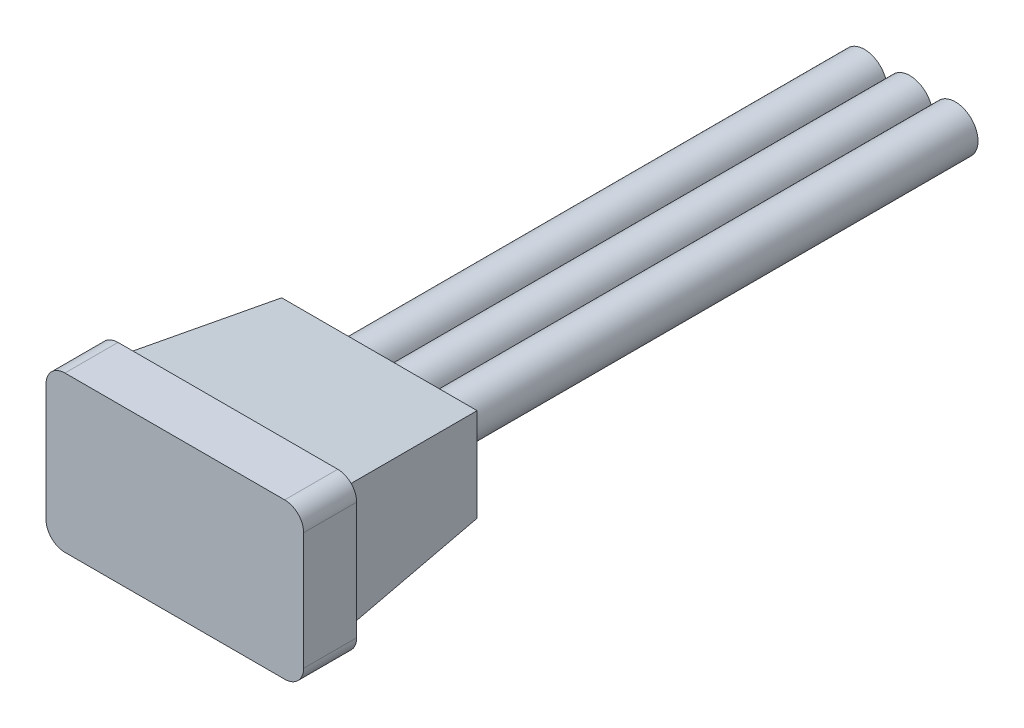
ISO-10303-21;
HEADER;
FILE_DESCRIPTION(('STEP AP214'),'2;1');
FILE_NAME('part.step','',(''),(''),'','','');
FILE_SCHEMA(('AUTOMOTIVE_DESIGN { 1 0 10303 214 1 1 1 1 }'));
ENDSEC;
DATA;
#1=APPLICATION_CONTEXT('core data for automotive mechanical design processes');
#2=APPLICATION_PROTOCOL_DEFINITION('international standard','automotive_design',2000,#1);
#3=PRODUCT_CONTEXT('',#1,'mechanical');
#4=PRODUCT('Part','Part','',(#3));
#5=PRODUCT_RELATED_PRODUCT_CATEGORY('part','',(#4));
#6=PRODUCT_DEFINITION_FORMATION('','',#4);
#7=PRODUCT_DEFINITION_CONTEXT('part definition',#1,'design');
#8=PRODUCT_DEFINITION('design','',#6,#7);
#9=PRODUCT_DEFINITION_SHAPE('','',#8);
#10=(LENGTH_UNIT() NAMED_UNIT(*) SI_UNIT(.MILLI.,.METRE.));
#11=(NAMED_UNIT(*) PLANE_ANGLE_UNIT() SI_UNIT($,.RADIAN.));
#12=(NAMED_UNIT(*) SI_UNIT($,.STERADIAN.) SOLID_ANGLE_UNIT());
#13=UNCERTAINTY_MEASURE_WITH_UNIT(LENGTH_MEASURE(1.E-05),#10,'distance_accuracy_value','');
#14=(GEOMETRIC_REPRESENTATION_CONTEXT(3) GLOBAL_UNCERTAINTY_ASSIGNED_CONTEXT((#13)) GLOBAL_UNIT_ASSIGNED_CONTEXT((#10,
#11,#12)) REPRESENTATION_CONTEXT('',''));
#15=CARTESIAN_POINT('',(0.,0.,0.));
#16=DIRECTION('',(0.,0.,1.));
#17=DIRECTION('',(1.,0.,0.));
#18=AXIS2_PLACEMENT_3D('',#15,#16,#17);
#19=CARTESIAN_POINT('',(1.2,0.,-21.0970562748477));
#20=DIRECTION('',(0.,0.,1.));
#21=DIRECTION('',(1.,0.,0.));
#22=AXIS2_PLACEMENT_3D('',#19,#20,#21);
#23=CYLINDRICAL_SURFACE('',#22,0.6);
#24=CARTESIAN_POINT('',(1.2,0.,-5.4));
#25=DIRECTION('',(0.,0.,-1.));
#26=DIRECTION('',(-1.,0.,0.));
#27=AXIS2_PLACEMENT_3D('',#24,#25,#26);
#28=CIRCLE('',#27,0.6);
#29=CARTESIAN_POINT('',(0.6,0.,-5.4));
#30=VERTEX_POINT('',#29);
#31=EDGE_CURVE('E56',#30,#30,#28,.T.);
#32=ORIENTED_EDGE('',*,*,#31,.T.);
#33=EDGE_LOOP('',(#32));
#34=FACE_BOUND('',#33,.T.);
#35=CARTESIAN_POINT('',(1.2,0.,-19.4));
#36=DIRECTION('',(0.,0.,-1.));
#37=DIRECTION('',(-1.,0.,0.));
#38=AXIS2_PLACEMENT_3D('',#35,#36,#37);
#39=CIRCLE('',#38,0.6);
#40=CARTESIAN_POINT('',(0.6,0.,-19.4));
#41=VERTEX_POINT('',#40);
#42=EDGE_CURVE('E11',#41,#41,#39,.T.);
#43=ORIENTED_EDGE('',*,*,#42,.F.);
#44=EDGE_LOOP('',(#43));
#45=FACE_BOUND('',#44,.T.);
#46=ADVANCED_FACE('F49',(#34,#45),#23,.T.);
#47=CARTESIAN_POINT('',(1.2,0.,-5.4));
#48=DIRECTION('',(0.,0.,-1.));
#49=DIRECTION('',(-1.,0.,0.));
#50=AXIS2_PLACEMENT_3D('',#47,#48,#49);
#51=PLANE('',#50);
#52=ORIENTED_EDGE('',*,*,#31,.F.);
#53=EDGE_LOOP('',(#52));
#54=FACE_BOUND('',#53,.T.);
#55=ADVANCED_FACE('F64',(#54),#51,.F.);
#56=CARTESIAN_POINT('',(0.,0.,-19.4));
#57=DIRECTION('',(0.,0.,-1.));
#58=DIRECTION('',(-1.,0.,0.));
#59=AXIS2_PLACEMENT_3D('',#56,#57,#58);
#60=PLANE('',#59);
#61=ORIENTED_EDGE('',*,*,#42,.T.);
#62=EDGE_LOOP('',(#61));
#63=FACE_BOUND('',#62,.T.);
#64=ADVANCED_FACE('F51',(#63),#60,.T.);
#65=CLOSED_SHELL('',(#46,#55,#64));
#66=MANIFOLD_SOLID_BREP('B2',#65);
#67=CARTESIAN_POINT('',(-1.2,0.,-21.0970562748477));
#68=DIRECTION('',(0.,0.,1.));
#69=DIRECTION('',(1.,0.,0.));
#70=AXIS2_PLACEMENT_3D('',#67,#68,#69);
#71=CYLINDRICAL_SURFACE('',#70,0.6);
#72=CARTESIAN_POINT('',(-1.2,0.,-5.4));
#73=DIRECTION('',(0.,0.,-1.));
#74=DIRECTION('',(-1.,0.,0.));
#75=AXIS2_PLACEMENT_3D('',#72,#73,#74);
#76=CIRCLE('',#75,0.6);
#77=CARTESIAN_POINT('',(-1.8,0.,-5.4));
#78=VERTEX_POINT('',#77);
#79=EDGE_CURVE('E105',#78,#78,#76,.T.);
#80=ORIENTED_EDGE('',*,*,#79,.T.);
#81=EDGE_LOOP('',(#80));
#82=FACE_BOUND('',#81,.T.);
#83=CARTESIAN_POINT('',(-1.2,0.,-19.4));
#84=DIRECTION('',(0.,0.,-1.));
#85=DIRECTION('',(-1.,0.,0.));
#86=AXIS2_PLACEMENT_3D('',#83,#84,#85);
#87=CIRCLE('',#86,0.6);
#88=CARTESIAN_POINT('',(-1.8,0.,-19.4));
#89=VERTEX_POINT('',#88);
#90=EDGE_CURVE('E48',#89,#89,#87,.T.);
#91=ORIENTED_EDGE('',*,*,#90,.F.);
#92=EDGE_LOOP('',(#91));
#93=FACE_BOUND('',#92,.T.);
#94=ADVANCED_FACE('F98',(#82,#93),#71,.T.);
#95=CARTESIAN_POINT('',(-1.2,0.,-5.4));
#96=DIRECTION('',(0.,0.,-1.));
#97=DIRECTION('',(-1.,0.,0.));
#98=AXIS2_PLACEMENT_3D('',#95,#96,#97);
#99=PLANE('',#98);
#100=ORIENTED_EDGE('',*,*,#79,.F.);
#101=EDGE_LOOP('',(#100));
#102=FACE_BOUND('',#101,.T.);
#103=ADVANCED_FACE('F113',(#102),#99,.F.);
#104=CARTESIAN_POINT('',(0.,0.,-19.4));
#105=DIRECTION('',(0.,0.,-1.));
#106=DIRECTION('',(-1.,0.,0.));
#107=AXIS2_PLACEMENT_3D('',#104,#105,#106);
#108=PLANE('',#107);
#109=ORIENTED_EDGE('',*,*,#90,.T.);
#110=EDGE_LOOP('',(#109));
#111=FACE_BOUND('',#110,.T.);
#112=ADVANCED_FACE('F100',(#111),#108,.T.);
#113=CLOSED_SHELL('',(#94,#103,#112));
#114=MANIFOLD_SOLID_BREP('B6',#113);
#115=CARTESIAN_POINT('',(0.,0.,-1.4));
#116=DIRECTION('',(0.,0.,1.));
#117=DIRECTION('',(1.,0.,0.));
#118=AXIS2_PLACEMENT_3D('',#115,#116,#117);
#119=PLANE('',#118);
#120=DIRECTION('',(1.,0.,0.));
#121=VECTOR('',#120,1.);
#122=CARTESIAN_POINT('',(-3.4,-2.05,-1.4));
#123=LINE('',#122,#121);
#124=CARTESIAN_POINT('',(-2.9,-2.05,-1.4));
#125=VERTEX_POINT('',#124);
#126=CARTESIAN_POINT('',(2.9,-2.05,-1.4));
#127=VERTEX_POINT('',#126);
#128=EDGE_CURVE('E276',#125,#127,#123,.T.);
#129=ORIENTED_EDGE('',*,*,#128,.F.);
#130=CARTESIAN_POINT('',(-2.9,-1.55,-1.4));
#131=DIRECTION('',(0.,0.,1.));
#132=DIRECTION('',(1.,0.,0.));
#133=AXIS2_PLACEMENT_3D('',#130,#131,#132);
#134=CIRCLE('',#133,0.5);
#135=CARTESIAN_POINT('',(-3.4,-1.55,-1.4));
#136=VERTEX_POINT('',#135);
#137=EDGE_CURVE('E313',#125,#136,#134,.F.);
#138=ORIENTED_EDGE('',*,*,#137,.T.);
#139=DIRECTION('',(0.,-1.,0.));
#140=VECTOR('',#139,1.);
#141=CARTESIAN_POINT('',(-3.4,2.05,-1.4));
#142=LINE('',#141,#140);
#143=CARTESIAN_POINT('',(-3.4,1.55,-1.4));
#144=VERTEX_POINT('',#143);
#145=EDGE_CURVE('E273',#144,#136,#142,.T.);
#146=ORIENTED_EDGE('',*,*,#145,.F.);
#147=CARTESIAN_POINT('',(-2.9,1.55,-1.4));
#148=DIRECTION('',(0.,0.,1.));
#149=DIRECTION('',(1.,0.,0.));
#150=AXIS2_PLACEMENT_3D('',#147,#148,#149);
#151=CIRCLE('',#150,0.5);
#152=CARTESIAN_POINT('',(-2.9,2.05,-1.4));
#153=VERTEX_POINT('',#152);
#154=EDGE_CURVE('E154',#144,#153,#151,.F.);
#155=ORIENTED_EDGE('',*,*,#154,.T.);
#156=DIRECTION('',(-1.,0.,0.));
#157=VECTOR('',#156,1.);
#158=CARTESIAN_POINT('',(-3.4,2.05,-1.4));
#159=LINE('',#158,#157);
#160=CARTESIAN_POINT('',(2.9,2.05,-1.4));
#161=VERTEX_POINT('',#160);
#162=EDGE_CURVE('E270',#161,#153,#159,.T.);
#163=ORIENTED_EDGE('',*,*,#162,.F.);
#164=CARTESIAN_POINT('',(2.9,1.55,-1.4));
#165=DIRECTION('',(0.,0.,1.));
#166=DIRECTION('',(1.,0.,0.));
#167=AXIS2_PLACEMENT_3D('',#164,#165,#166);
#168=CIRCLE('',#167,0.5);
#169=CARTESIAN_POINT('',(3.4,1.55,-1.4));
#170=VERTEX_POINT('',#169);
#171=EDGE_CURVE('E308',#161,#170,#168,.F.);
#172=ORIENTED_EDGE('',*,*,#171,.T.);
#173=DIRECTION('',(0.,1.,0.));
#174=VECTOR('',#173,1.);
#175=CARTESIAN_POINT('',(3.4,2.05,-1.4));
#176=LINE('',#175,#174);
#177=CARTESIAN_POINT('',(3.4,-1.55,-1.4));
#178=VERTEX_POINT('',#177);
#179=EDGE_CURVE('E267',#178,#170,#176,.T.);
#180=ORIENTED_EDGE('',*,*,#179,.F.);
#181=CARTESIAN_POINT('',(2.9,-1.55,-1.4));
#182=DIRECTION('',(0.,0.,1.));
#183=DIRECTION('',(1.,0.,0.));
#184=AXIS2_PLACEMENT_3D('',#181,#182,#183);
#185=CIRCLE('',#184,0.5);
#186=EDGE_CURVE('E310',#178,#127,#185,.F.);
#187=ORIENTED_EDGE('',*,*,#186,.T.);
#188=EDGE_LOOP('',(#129,#138,#146,#155,#163,#172,#180,#187));
#189=FACE_BOUND('',#188,.T.);
#190=DIRECTION('',(1.,0.,0.));
#191=VECTOR('',#190,1.);
#192=CARTESIAN_POINT('',(-3.,1.65,-1.4));
#193=LINE('',#192,#191);
#194=CARTESIAN_POINT('',(-3.,1.65,-1.4));
#195=VERTEX_POINT('',#194);
#196=CARTESIAN_POINT('',(3.,1.65,-1.4));
#197=VERTEX_POINT('',#196);
#198=EDGE_CURVE('E247',#195,#197,#193,.T.);
#199=ORIENTED_EDGE('',*,*,#198,.F.);
#200=DIRECTION('',(0.,1.,0.));
#201=VECTOR('',#200,1.);
#202=CARTESIAN_POINT('',(-3.,-1.65,-1.4));
#203=LINE('',#202,#201);
#204=CARTESIAN_POINT('',(-3.,-1.65,-1.4));
#205=VERTEX_POINT('',#204);
#206=EDGE_CURVE('E233',#205,#195,#203,.T.);
#207=ORIENTED_EDGE('',*,*,#206,.F.);
#208=DIRECTION('',(-1.,0.,0.));
#209=VECTOR('',#208,1.);
#210=CARTESIAN_POINT('',(3.,-1.65,-1.4));
#211=LINE('',#210,#209);
#212=CARTESIAN_POINT('',(3.,-1.65,-1.4));
#213=VERTEX_POINT('',#212);
#214=EDGE_CURVE('E228',#213,#205,#211,.T.);
#215=ORIENTED_EDGE('',*,*,#214,.F.);
#216=DIRECTION('',(0.,-1.,0.));
#217=VECTOR('',#216,1.);
#218=CARTESIAN_POINT('',(3.,1.65,-1.4));
#219=LINE('',#218,#217);
#220=EDGE_CURVE('E230',#197,#213,#219,.T.);
#221=ORIENTED_EDGE('',*,*,#220,.F.);
#222=EDGE_LOOP('',(#199,#207,#215,#221));
#223=FACE_BOUND('',#222,.T.);
#224=ADVANCED_FACE('F139',(#189,#223),#119,.F.);
#225=CARTESIAN_POINT('',(3.4,2.05,-1.4));
#226=DIRECTION('',(1.,0.,0.));
#227=DIRECTION('',(0.,1.,0.));
#228=AXIS2_PLACEMENT_3D('',#225,#226,#227);
#229=PLANE('',#228);
#230=DIRECTION('',(0.,1.,0.));
#231=VECTOR('',#230,1.);
#232=CARTESIAN_POINT('',(3.4,2.05,0.));
#233=LINE('',#232,#231);
#234=CARTESIAN_POINT('',(3.4,-1.55,0.));
#235=VERTEX_POINT('',#234);
#236=CARTESIAN_POINT('',(3.4,1.55,0.));
#237=VERTEX_POINT('',#236);
#238=EDGE_CURVE('E253',#235,#237,#233,.T.);
#239=ORIENTED_EDGE('',*,*,#238,.F.);
#240=DIRECTION('',(0.,0.,1.));
#241=VECTOR('',#240,1.);
#242=CARTESIAN_POINT('',(3.4,-1.55,-1.4));
#243=LINE('',#242,#241);
#244=EDGE_CURVE('E96',#235,#178,#243,.F.);
#245=ORIENTED_EDGE('',*,*,#244,.T.);
#246=ORIENTED_EDGE('',*,*,#179,.T.);
#247=DIRECTION('',(0.,0.,1.));
#248=VECTOR('',#247,1.);
#249=CARTESIAN_POINT('',(3.4,1.55,-1.4));
#250=LINE('',#249,#248);
#251=EDGE_CURVE('E147',#170,#237,#250,.T.);
#252=ORIENTED_EDGE('',*,*,#251,.T.);
#253=EDGE_LOOP('',(#239,#245,#246,#252));
#254=FACE_BOUND('',#253,.T.);
#255=ADVANCED_FACE('F322',(#254),#229,.T.);
#256=CARTESIAN_POINT('',(-3.4,-2.05,-1.4));
#257=DIRECTION('',(0.,-1.,0.));
#258=DIRECTION('',(0.,0.,-1.));
#259=AXIS2_PLACEMENT_3D('',#256,#257,#258);
#260=PLANE('',#259);
#261=DIRECTION('',(1.,0.,0.));
#262=VECTOR('',#261,1.);
#263=CARTESIAN_POINT('',(-3.4,-2.05,0.));
#264=LINE('',#263,#262);
#265=CARTESIAN_POINT('',(-2.9,-2.05,0.));
#266=VERTEX_POINT('',#265);
#267=CARTESIAN_POINT('',(2.9,-2.05,0.));
#268=VERTEX_POINT('',#267);
#269=EDGE_CURVE('E271',#266,#268,#264,.T.);
#270=ORIENTED_EDGE('',*,*,#269,.F.);
#271=DIRECTION('',(0.,0.,1.));
#272=VECTOR('',#271,1.);
#273=CARTESIAN_POINT('',(-2.9,-2.05,-1.4));
#274=LINE('',#273,#272);
#275=EDGE_CURVE('E306',#266,#125,#274,.F.);
#276=ORIENTED_EDGE('',*,*,#275,.T.);
#277=ORIENTED_EDGE('',*,*,#128,.T.);
#278=DIRECTION('',(0.,0.,1.));
#279=VECTOR('',#278,1.);
#280=CARTESIAN_POINT('',(2.9,-2.05,-1.4));
#281=LINE('',#280,#279);
#282=EDGE_CURVE('E303',#127,#268,#281,.T.);
#283=ORIENTED_EDGE('',*,*,#282,.T.);
#284=EDGE_LOOP('',(#270,#276,#277,#283));
#285=FACE_BOUND('',#284,.T.);
#286=ADVANCED_FACE('F335',(#285),#260,.T.);
#287=CARTESIAN_POINT('',(-3.4,2.05,-1.4));
#288=DIRECTION('',(-1.,0.,0.));
#289=DIRECTION('',(0.,-1.,0.));
#290=AXIS2_PLACEMENT_3D('',#287,#288,#289);
#291=PLANE('',#290);
#292=ORIENTED_EDGE('',*,*,#145,.T.);
#293=DIRECTION('',(0.,0.,1.));
#294=VECTOR('',#293,1.);
#295=CARTESIAN_POINT('',(-3.4,-1.55,-1.4));
#296=LINE('',#295,#294);
#297=CARTESIAN_POINT('',(-3.4,-1.55,0.));
#298=VERTEX_POINT('',#297);
#299=EDGE_CURVE('E292',#136,#298,#296,.T.);
#300=ORIENTED_EDGE('',*,*,#299,.T.);
#301=DIRECTION('',(0.,-1.,0.));
#302=VECTOR('',#301,1.);
#303=CARTESIAN_POINT('',(-3.4,2.05,0.));
#304=LINE('',#303,#302);
#305=CARTESIAN_POINT('',(-3.4,1.55,0.));
#306=VERTEX_POINT('',#305);
#307=EDGE_CURVE('E285',#306,#298,#304,.T.);
#308=ORIENTED_EDGE('',*,*,#307,.F.);
#309=DIRECTION('',(0.,0.,1.));
#310=VECTOR('',#309,1.);
#311=CARTESIAN_POINT('',(-3.4,1.55,-1.4));
#312=LINE('',#311,#310);
#313=EDGE_CURVE('E290',#306,#144,#312,.F.);
#314=ORIENTED_EDGE('',*,*,#313,.T.);
#315=EDGE_LOOP('',(#292,#300,#308,#314));
#316=FACE_BOUND('',#315,.T.);
#317=ADVANCED_FACE('F344',(#316),#291,.T.);
#318=CARTESIAN_POINT('',(-3.4,2.05,-1.4));
#319=DIRECTION('',(0.,1.,0.));
#320=DIRECTION('',(0.,0.,1.));
#321=AXIS2_PLACEMENT_3D('',#318,#319,#320);
#322=PLANE('',#321);
#323=ORIENTED_EDGE('',*,*,#162,.T.);
#324=DIRECTION('',(0.,0.,1.));
#325=VECTOR('',#324,1.);
#326=CARTESIAN_POINT('',(-2.9,2.05,-1.4));
#327=LINE('',#326,#325);
#328=CARTESIAN_POINT('',(-2.9,2.05,0.));
#329=VERTEX_POINT('',#328);
#330=EDGE_CURVE('E316',#153,#329,#327,.T.);
#331=ORIENTED_EDGE('',*,*,#330,.T.);
#332=DIRECTION('',(-1.,0.,0.));
#333=VECTOR('',#332,1.);
#334=CARTESIAN_POINT('',(-3.4,2.05,0.));
#335=LINE('',#334,#333);
#336=CARTESIAN_POINT('',(2.9,2.05,0.));
#337=VERTEX_POINT('',#336);
#338=EDGE_CURVE('E282',#337,#329,#335,.T.);
#339=ORIENTED_EDGE('',*,*,#338,.F.);
#340=DIRECTION('',(0.,0.,1.));
#341=VECTOR('',#340,1.);
#342=CARTESIAN_POINT('',(2.9,2.05,-1.4));
#343=LINE('',#342,#341);
#344=EDGE_CURVE('E161',#337,#161,#343,.F.);
#345=ORIENTED_EDGE('',*,*,#344,.T.);
#346=EDGE_LOOP('',(#323,#331,#339,#345));
#347=FACE_BOUND('',#346,.T.);
#348=ADVANCED_FACE('F349',(#347),#322,.T.);
#349=CARTESIAN_POINT('',(0.,0.,0.));
#350=DIRECTION('',(0.,0.,1.));
#351=DIRECTION('',(1.,0.,0.));
#352=AXIS2_PLACEMENT_3D('',#349,#350,#351);
#353=PLANE('',#352);
#354=ORIENTED_EDGE('',*,*,#307,.T.);
#355=CARTESIAN_POINT('',(-2.9,-1.55,0.));
#356=DIRECTION('',(0.,0.,1.));
#357=DIRECTION('',(1.,0.,0.));
#358=AXIS2_PLACEMENT_3D('',#355,#356,#357);
#359=CIRCLE('',#358,0.5);
#360=EDGE_CURVE('E301',#298,#266,#359,.T.);
#361=ORIENTED_EDGE('',*,*,#360,.T.);
#362=ORIENTED_EDGE('',*,*,#269,.T.);
#363=CARTESIAN_POINT('',(2.9,-1.55,0.));
#364=DIRECTION('',(0.,0.,1.));
#365=DIRECTION('',(1.,0.,0.));
#366=AXIS2_PLACEMENT_3D('',#363,#364,#365);
#367=CIRCLE('',#366,0.5);
#368=EDGE_CURVE('E297',#268,#235,#367,.T.);
#369=ORIENTED_EDGE('',*,*,#368,.T.);
#370=ORIENTED_EDGE('',*,*,#238,.T.);
#371=CARTESIAN_POINT('',(2.9,1.55,0.));
#372=DIRECTION('',(0.,0.,1.));
#373=DIRECTION('',(1.,0.,0.));
#374=AXIS2_PLACEMENT_3D('',#371,#372,#373);
#375=CIRCLE('',#374,0.5);
#376=EDGE_CURVE('E295',#237,#337,#375,.T.);
#377=ORIENTED_EDGE('',*,*,#376,.T.);
#378=ORIENTED_EDGE('',*,*,#338,.T.);
#379=CARTESIAN_POINT('',(-2.9,1.55,0.));
#380=DIRECTION('',(0.,0.,1.));
#381=DIRECTION('',(1.,0.,0.));
#382=AXIS2_PLACEMENT_3D('',#379,#380,#381);
#383=CIRCLE('',#382,0.5);
#384=EDGE_CURVE('E299',#329,#306,#383,.T.);
#385=ORIENTED_EDGE('',*,*,#384,.T.);
#386=EDGE_LOOP('',(#354,#361,#362,#369,#370,#377,#378,#385));
#387=FACE_BOUND('',#386,.T.);
#388=ADVANCED_FACE('F328',(#387),#353,.T.);
#389=CARTESIAN_POINT('',(-3.,1.65,-1.4));
#390=DIRECTION('',(0.,0.994521895368273,-0.104528463267654));
#391=DIRECTION('',(0.,0.104528463267654,0.994521895368273));
#392=AXIS2_PLACEMENT_3D('',#389,#390,#391);
#393=PLANE('',#392);
#394=ORIENTED_EDGE('',*,*,#198,.T.);
#395=DIRECTION('',(0.103962051184498,0.103962051184498,0.989132844377854));
#396=VECTOR('',#395,1.);
#397=CARTESIAN_POINT('',(3.,1.65,-1.4));
#398=LINE('',#397,#396);
#399=CARTESIAN_POINT('',(2.57958305893729,1.22958305893729,-5.4));
#400=VERTEX_POINT('',#399);
#401=EDGE_CURVE('E245',#400,#197,#398,.T.);
#402=ORIENTED_EDGE('',*,*,#401,.F.);
#403=DIRECTION('',(-1.,0.,0.));
#404=VECTOR('',#403,1.);
#405=CARTESIAN_POINT('',(-3.,1.22958305893729,-5.4));
#406=LINE('',#405,#404);
#407=CARTESIAN_POINT('',(-2.57958305893729,1.22958305893729,-5.4));
#408=VERTEX_POINT('',#407);
#409=EDGE_CURVE('E259',#408,#400,#406,.F.);
#410=ORIENTED_EDGE('',*,*,#409,.F.);
#411=DIRECTION('',(-0.103962051184498,0.103962051184498,0.989132844377854));
#412=VECTOR('',#411,1.);
#413=CARTESIAN_POINT('',(-3.,1.65,-1.4));
#414=LINE('',#413,#412);
#415=EDGE_CURVE('E255',#408,#195,#414,.T.);
#416=ORIENTED_EDGE('',*,*,#415,.T.);
#417=EDGE_LOOP('',(#394,#402,#410,#416));
#418=FACE_BOUND('',#417,.T.);
#419=ADVANCED_FACE('F365',(#418),#393,.T.);
#420=CARTESIAN_POINT('',(3.,1.65,-1.4));
#421=DIRECTION('',(0.994521895368273,0.,-0.104528463267654));
#422=DIRECTION('',(-0.104528463267654,0.,-0.994521895368273));
#423=AXIS2_PLACEMENT_3D('',#420,#421,#422);
#424=PLANE('',#423);
#425=ORIENTED_EDGE('',*,*,#220,.T.);
#426=DIRECTION('',(0.103962051184498,-0.103962051184498,0.989132844377854));
#427=VECTOR('',#426,1.);
#428=CARTESIAN_POINT('',(3.,-1.65,-1.4));
#429=LINE('',#428,#427);
#430=CARTESIAN_POINT('',(2.57958305893729,-1.22958305893729,-5.4));
#431=VERTEX_POINT('',#430);
#432=EDGE_CURVE('E242',#431,#213,#429,.T.);
#433=ORIENTED_EDGE('',*,*,#432,.F.);
#434=DIRECTION('',(0.,1.,0.));
#435=VECTOR('',#434,1.);
#436=CARTESIAN_POINT('',(2.57958305893729,1.65,-5.4));
#437=LINE('',#436,#435);
#438=EDGE_CURVE('E262',#400,#431,#437,.F.);
#439=ORIENTED_EDGE('',*,*,#438,.F.);
#440=ORIENTED_EDGE('',*,*,#401,.T.);
#441=EDGE_LOOP('',(#425,#433,#439,#440));
#442=FACE_BOUND('',#441,.T.);
#443=ADVANCED_FACE('F241',(#442),#424,.T.);
#444=CARTESIAN_POINT('',(3.,-1.65,-1.4));
#445=DIRECTION('',(0.,-0.994521895368273,-0.104528463267654));
#446=DIRECTION('',(0.,0.104528463267654,-0.994521895368273));
#447=AXIS2_PLACEMENT_3D('',#444,#445,#446);
#448=PLANE('',#447);
#449=ORIENTED_EDGE('',*,*,#214,.T.);
#450=DIRECTION('',(-0.103962051184498,-0.103962051184498,0.989132844377854));
#451=VECTOR('',#450,1.);
#452=CARTESIAN_POINT('',(-3.,-1.65,-1.4));
#453=LINE('',#452,#451);
#454=CARTESIAN_POINT('',(-2.57958305893729,-1.22958305893729,-5.4));
#455=VERTEX_POINT('',#454);
#456=EDGE_CURVE('E251',#455,#205,#453,.T.);
#457=ORIENTED_EDGE('',*,*,#456,.F.);
#458=DIRECTION('',(1.,0.,0.));
#459=VECTOR('',#458,1.);
#460=CARTESIAN_POINT('',(3.,-1.22958305893729,-5.4));
#461=LINE('',#460,#459);
#462=EDGE_CURVE('E250',#431,#455,#461,.F.);
#463=ORIENTED_EDGE('',*,*,#462,.F.);
#464=ORIENTED_EDGE('',*,*,#432,.T.);
#465=EDGE_LOOP('',(#449,#457,#463,#464));
#466=FACE_BOUND('',#465,.T.);
#467=ADVANCED_FACE('F249',(#466),#448,.T.);
#468=CARTESIAN_POINT('',(-3.,-1.65,-1.4));
#469=DIRECTION('',(-0.994521895368273,0.,-0.104528463267654));
#470=DIRECTION('',(-0.104528463267654,0.,0.994521895368273));
#471=AXIS2_PLACEMENT_3D('',#468,#469,#470);
#472=PLANE('',#471);
#473=ORIENTED_EDGE('',*,*,#206,.T.);
#474=ORIENTED_EDGE('',*,*,#415,.F.);
#475=DIRECTION('',(0.,-1.,0.));
#476=VECTOR('',#475,1.);
#477=CARTESIAN_POINT('',(-2.57958305893729,-1.65,-5.4));
#478=LINE('',#477,#476);
#479=EDGE_CURVE('E265',#455,#408,#478,.F.);
#480=ORIENTED_EDGE('',*,*,#479,.F.);
#481=ORIENTED_EDGE('',*,*,#456,.T.);
#482=EDGE_LOOP('',(#473,#474,#480,#481));
#483=FACE_BOUND('',#482,.T.);
#484=ADVANCED_FACE('F423',(#483),#472,.T.);
#485=CARTESIAN_POINT('',(0.,0.,-5.4));
#486=DIRECTION('',(0.,0.,-1.));
#487=DIRECTION('',(-1.,0.,0.));
#488=AXIS2_PLACEMENT_3D('',#485,#486,#487);
#489=PLANE('',#488);
#490=CARTESIAN_POINT('',(0.,0.,-5.4));
#491=DIRECTION('',(0.,0.,-1.));
#492=DIRECTION('',(-1.,0.,0.));
#493=AXIS2_PLACEMENT_3D('',#490,#491,#492);
#494=CIRCLE('',#493,0.6);
#495=CARTESIAN_POINT('',(-0.6,0.,-5.4));
#496=VERTEX_POINT('',#495);
#497=EDGE_CURVE('E279',#496,#496,#494,.T.);
#498=ORIENTED_EDGE('',*,*,#497,.F.);
#499=EDGE_LOOP('',(#498));
#500=FACE_BOUND('',#499,.T.);
#501=ORIENTED_EDGE('',*,*,#409,.T.);
#502=ORIENTED_EDGE('',*,*,#438,.T.);
#503=ORIENTED_EDGE('',*,*,#462,.T.);
#504=ORIENTED_EDGE('',*,*,#479,.T.);
#505=EDGE_LOOP('',(#501,#502,#503,#504));
#506=FACE_BOUND('',#505,.T.);
#507=ADVANCED_FACE('F414',(#500,#506),#489,.T.);
#508=CARTESIAN_POINT('',(0.,0.,-19.4));
#509=DIRECTION('',(0.,0.,1.));
#510=DIRECTION('',(1.,0.,0.));
#511=AXIS2_PLACEMENT_3D('',#508,#509,#510);
#512=CYLINDRICAL_SURFACE('',#511,0.6);
#513=CARTESIAN_POINT('',(0.,0.,-19.4));
#514=DIRECTION('',(0.,0.,-1.));
#515=DIRECTION('',(-1.,0.,0.));
#516=AXIS2_PLACEMENT_3D('',#513,#514,#515);
#517=CIRCLE('',#516,0.6);
#518=CARTESIAN_POINT('',(-0.6,0.,-19.4));
#519=VERTEX_POINT('',#518);
#520=EDGE_CURVE('E497',#519,#519,#517,.T.);
#521=ORIENTED_EDGE('',*,*,#520,.F.);
#522=EDGE_LOOP('',(#521));
#523=FACE_BOUND('',#522,.T.);
#524=ORIENTED_EDGE('',*,*,#497,.T.);
#525=EDGE_LOOP('',(#524));
#526=FACE_BOUND('',#525,.T.);
#527=ADVANCED_FACE('F405',(#523,#526),#512,.T.);
#528=CARTESIAN_POINT('',(0.,0.,-19.4));
#529=DIRECTION('',(0.,0.,-1.));
#530=DIRECTION('',(-1.,0.,0.));
#531=AXIS2_PLACEMENT_3D('',#528,#529,#530);
#532=PLANE('',#531);
#533=ORIENTED_EDGE('',*,*,#520,.T.);
#534=EDGE_LOOP('',(#533));
#535=FACE_BOUND('',#534,.T.);
#536=ADVANCED_FACE('F374',(#535),#532,.T.);
#537=CARTESIAN_POINT('',(-2.9,-1.55,-1.4));
#538=DIRECTION('',(0.,0.,1.));
#539=DIRECTION('',(1.,0.,0.));
#540=AXIS2_PLACEMENT_3D('',#537,#538,#539);
#541=CYLINDRICAL_SURFACE('',#540,0.5);
#542=ORIENTED_EDGE('',*,*,#137,.F.);
#543=ORIENTED_EDGE('',*,*,#275,.F.);
#544=ORIENTED_EDGE('',*,*,#360,.F.);
#545=ORIENTED_EDGE('',*,*,#299,.F.);
#546=EDGE_LOOP('',(#542,#543,#544,#545));
#547=FACE_BOUND('',#546,.T.);
#548=ADVANCED_FACE('F341',(#547),#541,.T.);
#549=CARTESIAN_POINT('',(-2.9,1.55,-1.4));
#550=DIRECTION('',(0.,0.,1.));
#551=DIRECTION('',(1.,0.,0.));
#552=AXIS2_PLACEMENT_3D('',#549,#550,#551);
#553=CYLINDRICAL_SURFACE('',#552,0.5);
#554=ORIENTED_EDGE('',*,*,#154,.F.);
#555=ORIENTED_EDGE('',*,*,#313,.F.);
#556=ORIENTED_EDGE('',*,*,#384,.F.);
#557=ORIENTED_EDGE('',*,*,#330,.F.);
#558=EDGE_LOOP('',(#554,#555,#556,#557));
#559=FACE_BOUND('',#558,.T.);
#560=ADVANCED_FACE('F348',(#559),#553,.T.);
#561=CARTESIAN_POINT('',(2.9,-1.55,-1.4));
#562=DIRECTION('',(0.,0.,1.));
#563=DIRECTION('',(1.,0.,0.));
#564=AXIS2_PLACEMENT_3D('',#561,#562,#563);
#565=CYLINDRICAL_SURFACE('',#564,0.5);
#566=ORIENTED_EDGE('',*,*,#186,.F.);
#567=ORIENTED_EDGE('',*,*,#244,.F.);
#568=ORIENTED_EDGE('',*,*,#368,.F.);
#569=ORIENTED_EDGE('',*,*,#282,.F.);
#570=EDGE_LOOP('',(#566,#567,#568,#569));
#571=FACE_BOUND('',#570,.T.);
#572=ADVANCED_FACE('F333',(#571),#565,.T.);
#573=CARTESIAN_POINT('',(2.9,1.55,-1.4));
#574=DIRECTION('',(0.,0.,1.));
#575=DIRECTION('',(1.,0.,0.));
#576=AXIS2_PLACEMENT_3D('',#573,#574,#575);
#577=CYLINDRICAL_SURFACE('',#576,0.5);
#578=ORIENTED_EDGE('',*,*,#171,.F.);
#579=ORIENTED_EDGE('',*,*,#344,.F.);
#580=ORIENTED_EDGE('',*,*,#376,.F.);
#581=ORIENTED_EDGE('',*,*,#251,.F.);
#582=EDGE_LOOP('',(#578,#579,#580,#581));
#583=FACE_BOUND('',#582,.T.);
#584=ADVANCED_FACE('F141',(#583),#577,.T.);
#585=CLOSED_SHELL('',(#224,#255,#286,#317,#348,#388,#419,#443,#467,#484,#507,#527,#536,#548,
#560,#572,#584));
#586=MANIFOLD_SOLID_BREP('B43',#585);
#587=ADVANCED_BREP_SHAPE_REPRESENTATION('',(#18,#66,#114,#586),#14);
#588=SHAPE_DEFINITION_REPRESENTATION(#9,#587);
ENDSEC;
END-ISO-10303-21;
